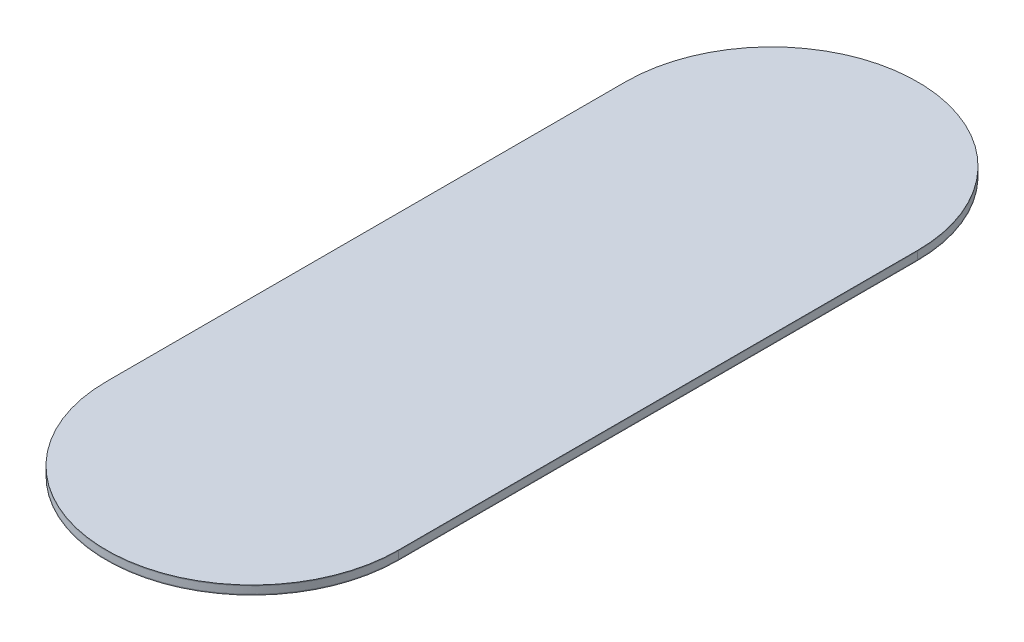
ISO-10303-21;
HEADER;
FILE_DESCRIPTION(('STEP AP214'),'2;1');
FILE_NAME('part.step','',(''),(''),'','','');
FILE_SCHEMA(('AUTOMOTIVE_DESIGN { 1 0 10303 214 1 1 1 1 }'));
ENDSEC;
DATA;
#1=APPLICATION_CONTEXT('core data for automotive mechanical design processes');
#2=APPLICATION_PROTOCOL_DEFINITION('international standard','automotive_design',2000,#1);
#3=PRODUCT_CONTEXT('',#1,'mechanical');
#4=PRODUCT('Part','Part','',(#3));
#5=PRODUCT_RELATED_PRODUCT_CATEGORY('part','',(#4));
#6=PRODUCT_DEFINITION_FORMATION('','',#4);
#7=PRODUCT_DEFINITION_CONTEXT('part definition',#1,'design');
#8=PRODUCT_DEFINITION('design','',#6,#7);
#9=PRODUCT_DEFINITION_SHAPE('','',#8);
#10=(LENGTH_UNIT() NAMED_UNIT(*) SI_UNIT(.MILLI.,.METRE.));
#11=(NAMED_UNIT(*) PLANE_ANGLE_UNIT() SI_UNIT($,.RADIAN.));
#12=(NAMED_UNIT(*) SI_UNIT($,.STERADIAN.) SOLID_ANGLE_UNIT());
#13=UNCERTAINTY_MEASURE_WITH_UNIT(LENGTH_MEASURE(1.E-05),#10,'distance_accuracy_value','');
#14=(GEOMETRIC_REPRESENTATION_CONTEXT(3) GLOBAL_UNCERTAINTY_ASSIGNED_CONTEXT((#13)) GLOBAL_UNIT_ASSIGNED_CONTEXT((#10,
#11,#12)) REPRESENTATION_CONTEXT('',''));
#15=CARTESIAN_POINT('',(0.,0.,0.));
#16=DIRECTION('',(0.,0.,1.));
#17=DIRECTION('',(1.,0.,0.));
#18=AXIS2_PLACEMENT_3D('',#15,#16,#17);
#19=CARTESIAN_POINT('',(0.,3.,-88.9));
#20=DIRECTION('',(0.,-1.,0.));
#21=DIRECTION('',(0.,0.,-1.));
#22=AXIS2_PLACEMENT_3D('',#19,#20,#21);
#23=CYLINDRICAL_SURFACE('',#22,50.);
#24=CARTESIAN_POINT('',(0.,2.75,-88.9));
#25=DIRECTION('',(0.,1.,0.));
#26=DIRECTION('',(0.,0.,1.));
#27=AXIS2_PLACEMENT_3D('',#24,#25,#26);
#28=CIRCLE('',#27,50.);
#29=CARTESIAN_POINT('',(50.,2.75,-88.9));
#30=VERTEX_POINT('',#29);
#31=CARTESIAN_POINT('',(-50.,2.75,-88.9));
#32=VERTEX_POINT('',#31);
#33=EDGE_CURVE('E121',#30,#32,#28,.T.);
#34=ORIENTED_EDGE('',*,*,#33,.T.);
#35=DIRECTION('',(0.,-1.,0.));
#36=VECTOR('',#35,1.);
#37=CARTESIAN_POINT('',(-50.,3.,-88.9));
#38=LINE('',#37,#36);
#39=CARTESIAN_POINT('',(-50.,3.,-88.9));
#40=VERTEX_POINT('',#39);
#41=EDGE_CURVE('E12',#40,#32,#38,.T.);
#42=ORIENTED_EDGE('',*,*,#41,.F.);
#43=CARTESIAN_POINT('',(0.,3.,-88.9));
#44=DIRECTION('',(0.,1.,0.));
#45=DIRECTION('',(0.,0.,1.));
#46=AXIS2_PLACEMENT_3D('',#43,#44,#45);
#47=CIRCLE('',#46,50.);
#48=CARTESIAN_POINT('',(50.,3.,-88.9));
#49=VERTEX_POINT('',#48);
#50=EDGE_CURVE('E109',#49,#40,#47,.T.);
#51=ORIENTED_EDGE('',*,*,#50,.F.);
#52=DIRECTION('',(0.,-1.,0.));
#53=VECTOR('',#52,1.);
#54=CARTESIAN_POINT('',(50.,3.,-88.9));
#55=LINE('',#54,#53);
#56=EDGE_CURVE('E117',#49,#30,#55,.T.);
#57=ORIENTED_EDGE('',*,*,#56,.T.);
#58=EDGE_LOOP('',(#34,#42,#51,#57));
#59=FACE_BOUND('',#58,.T.);
#60=ADVANCED_FACE('F58',(#59),#23,.T.);
#61=CARTESIAN_POINT('',(-50.,3.,-88.9));
#62=DIRECTION('',(1.,0.,0.));
#63=DIRECTION('',(0.,0.,-1.));
#64=AXIS2_PLACEMENT_3D('',#61,#62,#63);
#65=PLANE('',#64);
#66=DIRECTION('',(0.,0.,1.));
#67=VECTOR('',#66,1.);
#68=CARTESIAN_POINT('',(-50.,2.75,-88.9));
#69=LINE('',#68,#67);
#70=CARTESIAN_POINT('',(-50.,2.75,88.9));
#71=VERTEX_POINT('',#70);
#72=EDGE_CURVE('E113',#32,#71,#69,.T.);
#73=ORIENTED_EDGE('',*,*,#72,.T.);
#74=DIRECTION('',(0.,-1.,0.));
#75=VECTOR('',#74,1.);
#76=CARTESIAN_POINT('',(-50.,3.,88.9));
#77=LINE('',#76,#75);
#78=CARTESIAN_POINT('',(-50.,3.,88.9));
#79=VERTEX_POINT('',#78);
#80=EDGE_CURVE('E66',#79,#71,#77,.T.);
#81=ORIENTED_EDGE('',*,*,#80,.F.);
#82=DIRECTION('',(0.,0.,1.));
#83=VECTOR('',#82,1.);
#84=CARTESIAN_POINT('',(-50.,3.,-88.9));
#85=LINE('',#84,#83);
#86=EDGE_CURVE('E104',#40,#79,#85,.T.);
#87=ORIENTED_EDGE('',*,*,#86,.F.);
#88=ORIENTED_EDGE('',*,*,#41,.T.);
#89=EDGE_LOOP('',(#73,#81,#87,#88));
#90=FACE_BOUND('',#89,.T.);
#91=ADVANCED_FACE('F112',(#90),#65,.F.);
#92=CARTESIAN_POINT('',(0.,3.,88.9));
#93=DIRECTION('',(0.,-1.,0.));
#94=DIRECTION('',(0.,0.,-1.));
#95=AXIS2_PLACEMENT_3D('',#92,#93,#94);
#96=CYLINDRICAL_SURFACE('',#95,50.);
#97=CARTESIAN_POINT('',(0.,2.75,88.9));
#98=DIRECTION('',(0.,1.,0.));
#99=DIRECTION('',(0.,0.,1.));
#100=AXIS2_PLACEMENT_3D('',#97,#98,#99);
#101=CIRCLE('',#100,50.);
#102=CARTESIAN_POINT('',(50.,2.75,88.9));
#103=VERTEX_POINT('',#102);
#104=EDGE_CURVE('E91',#71,#103,#101,.T.);
#105=ORIENTED_EDGE('',*,*,#104,.T.);
#106=DIRECTION('',(0.,-1.,0.));
#107=VECTOR('',#106,1.);
#108=CARTESIAN_POINT('',(50.,3.,88.9));
#109=LINE('',#108,#107);
#110=CARTESIAN_POINT('',(50.,3.,88.9));
#111=VERTEX_POINT('',#110);
#112=EDGE_CURVE('E114',#111,#103,#109,.T.);
#113=ORIENTED_EDGE('',*,*,#112,.F.);
#114=CARTESIAN_POINT('',(0.,3.,88.9));
#115=DIRECTION('',(0.,1.,0.));
#116=DIRECTION('',(0.,0.,1.));
#117=AXIS2_PLACEMENT_3D('',#114,#115,#116);
#118=CIRCLE('',#117,50.);
#119=EDGE_CURVE('E107',#79,#111,#118,.T.);
#120=ORIENTED_EDGE('',*,*,#119,.F.);
#121=ORIENTED_EDGE('',*,*,#80,.T.);
#122=EDGE_LOOP('',(#105,#113,#120,#121));
#123=FACE_BOUND('',#122,.T.);
#124=ADVANCED_FACE('F115',(#123),#96,.T.);
#125=CARTESIAN_POINT('',(50.,3.,88.9));
#126=DIRECTION('',(-1.,0.,0.));
#127=DIRECTION('',(0.,0.,1.));
#128=AXIS2_PLACEMENT_3D('',#125,#126,#127);
#129=PLANE('',#128);
#130=DIRECTION('',(0.,0.,-1.));
#131=VECTOR('',#130,1.);
#132=CARTESIAN_POINT('',(50.,2.75,88.9));
#133=LINE('',#132,#131);
#134=EDGE_CURVE('E97',#103,#30,#133,.T.);
#135=ORIENTED_EDGE('',*,*,#134,.T.);
#136=ORIENTED_EDGE('',*,*,#56,.F.);
#137=DIRECTION('',(0.,0.,-1.));
#138=VECTOR('',#137,1.);
#139=CARTESIAN_POINT('',(50.,3.,88.9));
#140=LINE('',#139,#138);
#141=EDGE_CURVE('E74',#111,#49,#140,.T.);
#142=ORIENTED_EDGE('',*,*,#141,.F.);
#143=ORIENTED_EDGE('',*,*,#112,.T.);
#144=EDGE_LOOP('',(#135,#136,#142,#143));
#145=FACE_BOUND('',#144,.T.);
#146=ADVANCED_FACE('F128',(#145),#129,.F.);
#147=CARTESIAN_POINT('',(0.,3.,-88.9));
#148=DIRECTION('',(0.,1.,0.));
#149=DIRECTION('',(0.,0.,1.));
#150=AXIS2_PLACEMENT_3D('',#147,#148,#149);
#151=PLANE('',#150);
#152=ORIENTED_EDGE('',*,*,#50,.T.);
#153=ORIENTED_EDGE('',*,*,#86,.T.);
#154=ORIENTED_EDGE('',*,*,#119,.T.);
#155=ORIENTED_EDGE('',*,*,#141,.T.);
#156=EDGE_LOOP('',(#152,#153,#154,#155));
#157=FACE_BOUND('',#156,.T.);
#158=ADVANCED_FACE('F105',(#157),#151,.T.);
#159=CARTESIAN_POINT('',(0.,2.75,-88.9));
#160=DIRECTION('',(0.,1.,0.));
#161=DIRECTION('',(0.,0.,1.));
#162=AXIS2_PLACEMENT_3D('',#159,#160,#161);
#163=PLANE('',#162);
#164=ORIENTED_EDGE('',*,*,#33,.F.);
#165=ORIENTED_EDGE('',*,*,#134,.F.);
#166=ORIENTED_EDGE('',*,*,#104,.F.);
#167=ORIENTED_EDGE('',*,*,#72,.F.);
#168=EDGE_LOOP('',(#164,#165,#166,#167));
#169=FACE_BOUND('',#168,.T.);
#170=ADVANCED_FACE('F131',(#169),#163,.F.);
#171=CLOSED_SHELL('',(#60,#91,#124,#146,#158,#170));
#172=MANIFOLD_SOLID_BREP('B2',#171);
#173=CARTESIAN_POINT('',(0.,2.75,-88.9));
#174=DIRECTION('',(0.,-1.,0.));
#175=DIRECTION('',(0.,0.,-1.));
#176=AXIS2_PLACEMENT_3D('',#173,#174,#175);
#177=CYLINDRICAL_SURFACE('',#176,50.);
#178=CARTESIAN_POINT('',(0.,0.25,-88.9));
#179=DIRECTION('',(0.,1.,0.));
#180=DIRECTION('',(0.,0.,1.));
#181=AXIS2_PLACEMENT_3D('',#178,#179,#180);
#182=CIRCLE('',#181,50.);
#183=CARTESIAN_POINT('',(50.,0.25,-88.9));
#184=VERTEX_POINT('',#183);
#185=CARTESIAN_POINT('',(-50.,0.25,-88.9));
#186=VERTEX_POINT('',#185);
#187=EDGE_CURVE('E259',#184,#186,#182,.T.);
#188=ORIENTED_EDGE('',*,*,#187,.T.);
#189=DIRECTION('',(0.,-1.,0.));
#190=VECTOR('',#189,1.);
#191=CARTESIAN_POINT('',(-50.,2.75,-88.9));
#192=LINE('',#191,#190);
#193=CARTESIAN_POINT('',(-50.,2.75,-88.9));
#194=VERTEX_POINT('',#193);
#195=EDGE_CURVE('E56',#194,#186,#192,.T.);
#196=ORIENTED_EDGE('',*,*,#195,.F.);
#197=CARTESIAN_POINT('',(0.,2.75,-88.9));
#198=DIRECTION('',(0.,1.,0.));
#199=DIRECTION('',(0.,0.,1.));
#200=AXIS2_PLACEMENT_3D('',#197,#198,#199);
#201=CIRCLE('',#200,50.);
#202=CARTESIAN_POINT('',(50.,2.75,-88.9));
#203=VERTEX_POINT('',#202);
#204=EDGE_CURVE('E243',#203,#194,#201,.T.);
#205=ORIENTED_EDGE('',*,*,#204,.F.);
#206=DIRECTION('',(0.,-1.,0.));
#207=VECTOR('',#206,1.);
#208=CARTESIAN_POINT('',(50.,2.75,-88.9));
#209=LINE('',#208,#207);
#210=EDGE_CURVE('E255',#203,#184,#209,.T.);
#211=ORIENTED_EDGE('',*,*,#210,.T.);
#212=EDGE_LOOP('',(#188,#196,#205,#211));
#213=FACE_BOUND('',#212,.T.);
#214=ADVANCED_FACE('F191',(#213),#177,.T.);
#215=CARTESIAN_POINT('',(-50.,2.75,-88.9));
#216=DIRECTION('',(1.,0.,0.));
#217=DIRECTION('',(0.,0.,-1.));
#218=AXIS2_PLACEMENT_3D('',#215,#216,#217);
#219=PLANE('',#218);
#220=DIRECTION('',(0.,0.,1.));
#221=VECTOR('',#220,1.);
#222=CARTESIAN_POINT('',(-50.,0.25,-88.9));
#223=LINE('',#222,#221);
#224=CARTESIAN_POINT('',(-50.,0.25,88.9));
#225=VERTEX_POINT('',#224);
#226=EDGE_CURVE('E248',#186,#225,#223,.T.);
#227=ORIENTED_EDGE('',*,*,#226,.T.);
#228=DIRECTION('',(0.,-1.,0.));
#229=VECTOR('',#228,1.);
#230=CARTESIAN_POINT('',(-50.,2.75,88.9));
#231=LINE('',#230,#229);
#232=CARTESIAN_POINT('',(-50.,2.75,88.9));
#233=VERTEX_POINT('',#232);
#234=EDGE_CURVE('E200',#233,#225,#231,.T.);
#235=ORIENTED_EDGE('',*,*,#234,.F.);
#236=DIRECTION('',(0.,0.,1.));
#237=VECTOR('',#236,1.);
#238=CARTESIAN_POINT('',(-50.,2.75,-88.9));
#239=LINE('',#238,#237);
#240=EDGE_CURVE('E238',#194,#233,#239,.T.);
#241=ORIENTED_EDGE('',*,*,#240,.F.);
#242=ORIENTED_EDGE('',*,*,#195,.T.);
#243=EDGE_LOOP('',(#227,#235,#241,#242));
#244=FACE_BOUND('',#243,.T.);
#245=ADVANCED_FACE('F247',(#244),#219,.F.);
#246=CARTESIAN_POINT('',(0.,2.75,88.9));
#247=DIRECTION('',(0.,-1.,0.));
#248=DIRECTION('',(0.,0.,-1.));
#249=AXIS2_PLACEMENT_3D('',#246,#247,#248);
#250=CYLINDRICAL_SURFACE('',#249,50.);
#251=CARTESIAN_POINT('',(0.,0.25,88.9));
#252=DIRECTION('',(0.,1.,0.));
#253=DIRECTION('',(0.,0.,1.));
#254=AXIS2_PLACEMENT_3D('',#251,#252,#253);
#255=CIRCLE('',#254,50.);
#256=CARTESIAN_POINT('',(50.,0.25,88.9));
#257=VERTEX_POINT('',#256);
#258=EDGE_CURVE('E225',#225,#257,#255,.T.);
#259=ORIENTED_EDGE('',*,*,#258,.T.);
#260=DIRECTION('',(0.,-1.,0.));
#261=VECTOR('',#260,1.);
#262=CARTESIAN_POINT('',(50.,2.75,88.9));
#263=LINE('',#262,#261);
#264=CARTESIAN_POINT('',(50.,2.75,88.9));
#265=VERTEX_POINT('',#264);
#266=EDGE_CURVE('E250',#265,#257,#263,.T.);
#267=ORIENTED_EDGE('',*,*,#266,.F.);
#268=CARTESIAN_POINT('',(0.,2.75,88.9));
#269=DIRECTION('',(0.,1.,0.));
#270=DIRECTION('',(0.,0.,1.));
#271=AXIS2_PLACEMENT_3D('',#268,#269,#270);
#272=CIRCLE('',#271,50.);
#273=EDGE_CURVE('E241',#233,#265,#272,.T.);
#274=ORIENTED_EDGE('',*,*,#273,.F.);
#275=ORIENTED_EDGE('',*,*,#234,.T.);
#276=EDGE_LOOP('',(#259,#267,#274,#275));
#277=FACE_BOUND('',#276,.T.);
#278=ADVANCED_FACE('F251',(#277),#250,.T.);
#279=CARTESIAN_POINT('',(50.,2.75,88.9));
#280=DIRECTION('',(-1.,0.,0.));
#281=DIRECTION('',(0.,0.,1.));
#282=AXIS2_PLACEMENT_3D('',#279,#280,#281);
#283=PLANE('',#282);
#284=DIRECTION('',(0.,0.,-1.));
#285=VECTOR('',#284,1.);
#286=CARTESIAN_POINT('',(50.,0.25,88.9));
#287=LINE('',#286,#285);
#288=EDGE_CURVE('E231',#257,#184,#287,.T.);
#289=ORIENTED_EDGE('',*,*,#288,.T.);
#290=ORIENTED_EDGE('',*,*,#210,.F.);
#291=DIRECTION('',(0.,0.,-1.));
#292=VECTOR('',#291,1.);
#293=CARTESIAN_POINT('',(50.,2.75,88.9));
#294=LINE('',#293,#292);
#295=EDGE_CURVE('E208',#265,#203,#294,.T.);
#296=ORIENTED_EDGE('',*,*,#295,.F.);
#297=ORIENTED_EDGE('',*,*,#266,.T.);
#298=EDGE_LOOP('',(#289,#290,#296,#297));
#299=FACE_BOUND('',#298,.T.);
#300=ADVANCED_FACE('F272',(#299),#283,.F.);
#301=CARTESIAN_POINT('',(0.,2.75,-88.9));
#302=DIRECTION('',(0.,1.,0.));
#303=DIRECTION('',(0.,0.,1.));
#304=AXIS2_PLACEMENT_3D('',#301,#302,#303);
#305=PLANE('',#304);
#306=ORIENTED_EDGE('',*,*,#204,.T.);
#307=ORIENTED_EDGE('',*,*,#240,.T.);
#308=ORIENTED_EDGE('',*,*,#273,.T.);
#309=ORIENTED_EDGE('',*,*,#295,.T.);
#310=EDGE_LOOP('',(#306,#307,#308,#309));
#311=FACE_BOUND('',#310,.T.);
#312=ADVANCED_FACE('F239',(#311),#305,.T.);
#313=CARTESIAN_POINT('',(0.,0.25,-88.9));
#314=DIRECTION('',(0.,1.,0.));
#315=DIRECTION('',(0.,0.,1.));
#316=AXIS2_PLACEMENT_3D('',#313,#314,#315);
#317=PLANE('',#316);
#318=ORIENTED_EDGE('',*,*,#187,.F.);
#319=ORIENTED_EDGE('',*,*,#288,.F.);
#320=ORIENTED_EDGE('',*,*,#258,.F.);
#321=ORIENTED_EDGE('',*,*,#226,.F.);
#322=EDGE_LOOP('',(#318,#319,#320,#321));
#323=FACE_BOUND('',#322,.T.);
#324=ADVANCED_FACE('F275',(#323),#317,.F.);
#325=CLOSED_SHELL('',(#214,#245,#278,#300,#312,#324));
#326=MANIFOLD_SOLID_BREP('B6',#325);
#327=CARTESIAN_POINT('',(0.,0.25,-88.9));
#328=DIRECTION('',(0.,-1.,0.));
#329=DIRECTION('',(0.,0.,-1.));
#330=AXIS2_PLACEMENT_3D('',#327,#328,#329);
#331=CYLINDRICAL_SURFACE('',#330,50.);
#332=CARTESIAN_POINT('',(0.,0.,-88.9));
#333=DIRECTION('',(0.,1.,0.));
#334=DIRECTION('',(0.,0.,1.));
#335=AXIS2_PLACEMENT_3D('',#332,#333,#334);
#336=CIRCLE('',#335,50.);
#337=CARTESIAN_POINT('',(50.,0.,-88.9));
#338=VERTEX_POINT('',#337);
#339=CARTESIAN_POINT('',(-50.,0.,-88.9));
#340=VERTEX_POINT('',#339);
#341=EDGE_CURVE('E390',#338,#340,#336,.T.);
#342=ORIENTED_EDGE('',*,*,#341,.T.);
#343=DIRECTION('',(0.,-1.,0.));
#344=VECTOR('',#343,1.);
#345=CARTESIAN_POINT('',(-50.,0.25,-88.9));
#346=LINE('',#345,#344);
#347=CARTESIAN_POINT('',(-50.,0.25,-88.9));
#348=VERTEX_POINT('',#347);
#349=EDGE_CURVE('E189',#348,#340,#346,.T.);
#350=ORIENTED_EDGE('',*,*,#349,.F.);
#351=CARTESIAN_POINT('',(0.,0.25,-88.9));
#352=DIRECTION('',(0.,1.,0.));
#353=DIRECTION('',(0.,0.,1.));
#354=AXIS2_PLACEMENT_3D('',#351,#352,#353);
#355=CIRCLE('',#354,50.);
#356=CARTESIAN_POINT('',(50.,0.25,-88.9));
#357=VERTEX_POINT('',#356);
#358=EDGE_CURVE('E378',#357,#348,#355,.T.);
#359=ORIENTED_EDGE('',*,*,#358,.F.);
#360=DIRECTION('',(0.,-1.,0.));
#361=VECTOR('',#360,1.);
#362=CARTESIAN_POINT('',(50.,0.25,-88.9));
#363=LINE('',#362,#361);
#364=EDGE_CURVE('E386',#357,#338,#363,.T.);
#365=ORIENTED_EDGE('',*,*,#364,.T.);
#366=EDGE_LOOP('',(#342,#350,#359,#365));
#367=FACE_BOUND('',#366,.T.);
#368=ADVANCED_FACE('F327',(#367),#331,.T.);
#369=CARTESIAN_POINT('',(-50.,0.25,-88.9));
#370=DIRECTION('',(1.,0.,0.));
#371=DIRECTION('',(0.,0.,-1.));
#372=AXIS2_PLACEMENT_3D('',#369,#370,#371);
#373=PLANE('',#372);
#374=DIRECTION('',(0.,0.,1.));
#375=VECTOR('',#374,1.);
#376=CARTESIAN_POINT('',(-50.,0.,-88.9));
#377=LINE('',#376,#375);
#378=CARTESIAN_POINT('',(-50.,0.,88.9));
#379=VERTEX_POINT('',#378);
#380=EDGE_CURVE('E382',#340,#379,#377,.T.);
#381=ORIENTED_EDGE('',*,*,#380,.T.);
#382=DIRECTION('',(0.,-1.,0.));
#383=VECTOR('',#382,1.);
#384=CARTESIAN_POINT('',(-50.,0.25,88.9));
#385=LINE('',#384,#383);
#386=CARTESIAN_POINT('',(-50.,0.25,88.9));
#387=VERTEX_POINT('',#386);
#388=EDGE_CURVE('E335',#387,#379,#385,.T.);
#389=ORIENTED_EDGE('',*,*,#388,.F.);
#390=DIRECTION('',(0.,0.,1.));
#391=VECTOR('',#390,1.);
#392=CARTESIAN_POINT('',(-50.,0.25,-88.9));
#393=LINE('',#392,#391);
#394=EDGE_CURVE('E373',#348,#387,#393,.T.);
#395=ORIENTED_EDGE('',*,*,#394,.F.);
#396=ORIENTED_EDGE('',*,*,#349,.T.);
#397=EDGE_LOOP('',(#381,#389,#395,#396));
#398=FACE_BOUND('',#397,.T.);
#399=ADVANCED_FACE('F381',(#398),#373,.F.);
#400=CARTESIAN_POINT('',(0.,0.25,88.9));
#401=DIRECTION('',(0.,-1.,0.));
#402=DIRECTION('',(0.,0.,-1.));
#403=AXIS2_PLACEMENT_3D('',#400,#401,#402);
#404=CYLINDRICAL_SURFACE('',#403,50.);
#405=CARTESIAN_POINT('',(0.,0.,88.9));
#406=DIRECTION('',(0.,1.,0.));
#407=DIRECTION('',(0.,0.,1.));
#408=AXIS2_PLACEMENT_3D('',#405,#406,#407);
#409=CIRCLE('',#408,50.);
#410=CARTESIAN_POINT('',(50.0000000000001,0.,88.9));
#411=VERTEX_POINT('',#410);
#412=EDGE_CURVE('E360',#379,#411,#409,.T.);
#413=ORIENTED_EDGE('',*,*,#412,.T.);
#414=DIRECTION('',(0.,-1.,0.));
#415=VECTOR('',#414,1.);
#416=CARTESIAN_POINT('',(50.0000000000001,0.25,88.9));
#417=LINE('',#416,#415);
#418=CARTESIAN_POINT('',(50.0000000000001,0.25,88.9));
#419=VERTEX_POINT('',#418);
#420=EDGE_CURVE('E383',#419,#411,#417,.T.);
#421=ORIENTED_EDGE('',*,*,#420,.F.);
#422=CARTESIAN_POINT('',(0.,0.25,88.9));
#423=DIRECTION('',(0.,1.,0.));
#424=DIRECTION('',(0.,0.,1.));
#425=AXIS2_PLACEMENT_3D('',#422,#423,#424);
#426=CIRCLE('',#425,50.);
#427=EDGE_CURVE('E376',#387,#419,#426,.T.);
#428=ORIENTED_EDGE('',*,*,#427,.F.);
#429=ORIENTED_EDGE('',*,*,#388,.T.);
#430=EDGE_LOOP('',(#413,#421,#428,#429));
#431=FACE_BOUND('',#430,.T.);
#432=ADVANCED_FACE('F384',(#431),#404,.T.);
#433=CARTESIAN_POINT('',(50.,0.25,-88.9));
#434=DIRECTION('',(-1.,0.,0.));
#435=DIRECTION('',(0.,0.,1.));
#436=AXIS2_PLACEMENT_3D('',#433,#434,#435);
#437=PLANE('',#436);
#438=DIRECTION('',(0.,0.,-1.));
#439=VECTOR('',#438,1.);
#440=CARTESIAN_POINT('',(50.,0.,-88.9));
#441=LINE('',#440,#439);
#442=EDGE_CURVE('E366',#411,#338,#441,.T.);
#443=ORIENTED_EDGE('',*,*,#442,.T.);
#444=ORIENTED_EDGE('',*,*,#364,.F.);
#445=DIRECTION('',(0.,0.,-1.));
#446=VECTOR('',#445,1.);
#447=CARTESIAN_POINT('',(50.,0.25,-88.9));
#448=LINE('',#447,#446);
#449=EDGE_CURVE('E343',#419,#357,#448,.T.);
#450=ORIENTED_EDGE('',*,*,#449,.F.);
#451=ORIENTED_EDGE('',*,*,#420,.T.);
#452=EDGE_LOOP('',(#443,#444,#450,#451));
#453=FACE_BOUND('',#452,.T.);
#454=ADVANCED_FACE('F397',(#453),#437,.F.);
#455=CARTESIAN_POINT('',(0.,0.25,-88.9));
#456=DIRECTION('',(0.,1.,0.));
#457=DIRECTION('',(0.,0.,1.));
#458=AXIS2_PLACEMENT_3D('',#455,#456,#457);
#459=PLANE('',#458);
#460=ORIENTED_EDGE('',*,*,#358,.T.);
#461=ORIENTED_EDGE('',*,*,#394,.T.);
#462=ORIENTED_EDGE('',*,*,#427,.T.);
#463=ORIENTED_EDGE('',*,*,#449,.T.);
#464=EDGE_LOOP('',(#460,#461,#462,#463));
#465=FACE_BOUND('',#464,.T.);
#466=ADVANCED_FACE('F374',(#465),#459,.T.);
#467=CARTESIAN_POINT('',(0.,0.,-88.9));
#468=DIRECTION('',(0.,1.,0.));
#469=DIRECTION('',(0.,0.,1.));
#470=AXIS2_PLACEMENT_3D('',#467,#468,#469);
#471=PLANE('',#470);
#472=ORIENTED_EDGE('',*,*,#341,.F.);
#473=ORIENTED_EDGE('',*,*,#442,.F.);
#474=ORIENTED_EDGE('',*,*,#412,.F.);
#475=ORIENTED_EDGE('',*,*,#380,.F.);
#476=EDGE_LOOP('',(#472,#473,#474,#475));
#477=FACE_BOUND('',#476,.T.);
#478=ADVANCED_FACE('F400',(#477),#471,.F.);
#479=CLOSED_SHELL('',(#368,#399,#432,#454,#466,#478));
#480=MANIFOLD_SOLID_BREP('B50',#479);
#481=ADVANCED_BREP_SHAPE_REPRESENTATION('',(#18,#172,#326,#480),#14);
#482=SHAPE_DEFINITION_REPRESENTATION(#9,#481);
ENDSEC;
END-ISO-10303-21;
